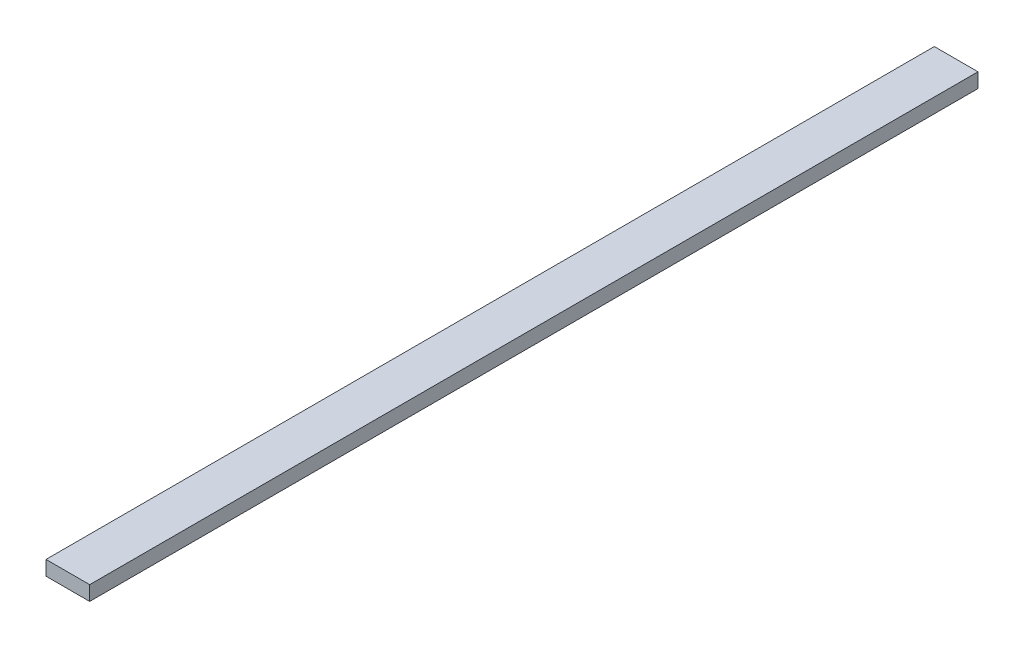
ISO-10303-21;
HEADER;
FILE_DESCRIPTION(('STEP AP214'),'2;1');
FILE_NAME('part.step','',(''),(''),'','','');
FILE_SCHEMA(('AUTOMOTIVE_DESIGN { 1 0 10303 214 1 1 1 1 }'));
ENDSEC;
DATA;
#1=APPLICATION_CONTEXT('core data for automotive mechanical design processes');
#2=APPLICATION_PROTOCOL_DEFINITION('international standard','automotive_design',2000,#1);
#3=PRODUCT_CONTEXT('',#1,'mechanical');
#4=PRODUCT('Part','Part','',(#3));
#5=PRODUCT_RELATED_PRODUCT_CATEGORY('part','',(#4));
#6=PRODUCT_DEFINITION_FORMATION('','',#4);
#7=PRODUCT_DEFINITION_CONTEXT('part definition',#1,'design');
#8=PRODUCT_DEFINITION('design','',#6,#7);
#9=PRODUCT_DEFINITION_SHAPE('','',#8);
#10=(LENGTH_UNIT() NAMED_UNIT(*) SI_UNIT(.MILLI.,.METRE.));
#11=(NAMED_UNIT(*) PLANE_ANGLE_UNIT() SI_UNIT($,.RADIAN.));
#12=(NAMED_UNIT(*) SI_UNIT($,.STERADIAN.) SOLID_ANGLE_UNIT());
#13=UNCERTAINTY_MEASURE_WITH_UNIT(LENGTH_MEASURE(1.E-05),#10,'distance_accuracy_value','');
#14=(GEOMETRIC_REPRESENTATION_CONTEXT(3) GLOBAL_UNCERTAINTY_ASSIGNED_CONTEXT((#13)) GLOBAL_UNIT_ASSIGNED_CONTEXT((#10,
#11,#12)) REPRESENTATION_CONTEXT('',''));
#15=CARTESIAN_POINT('',(0.,0.,0.));
#16=DIRECTION('',(0.,0.,1.));
#17=DIRECTION('',(1.,0.,0.));
#18=AXIS2_PLACEMENT_3D('',#15,#16,#17);
#19=CARTESIAN_POINT('',(168.000000000052,-8.5,305.));
#20=DIRECTION('',(0.,1.,0.));
#21=DIRECTION('',(0.,0.,1.));
#22=AXIS2_PLACEMENT_3D('',#19,#20,#21);
#23=PLANE('',#22);
#24=DIRECTION('',(1.,0.,0.));
#25=VECTOR('',#24,1.);
#26=CARTESIAN_POINT('',(168.000000000052,-8.5,0.));
#27=LINE('',#26,#25);
#28=CARTESIAN_POINT('',(168.000000000052,-8.5,0.));
#29=VERTEX_POINT('',#28);
#30=CARTESIAN_POINT('',(183.000000000052,-8.5,0.));
#31=VERTEX_POINT('',#30);
#32=EDGE_CURVE('E96',#29,#31,#27,.T.);
#33=ORIENTED_EDGE('',*,*,#32,.T.);
#34=DIRECTION('',(0.,0.,-1.));
#35=VECTOR('',#34,1.);
#36=CARTESIAN_POINT('',(183.000000000052,-8.5,305.));
#37=LINE('',#36,#35);
#38=CARTESIAN_POINT('',(183.000000000052,-8.5,305.));
#39=VERTEX_POINT('',#38);
#40=EDGE_CURVE('E11',#39,#31,#37,.T.);
#41=ORIENTED_EDGE('',*,*,#40,.F.);
#42=DIRECTION('',(1.,0.,0.));
#43=VECTOR('',#42,1.);
#44=CARTESIAN_POINT('',(168.000000000052,-8.5,305.));
#45=LINE('',#44,#43);
#46=CARTESIAN_POINT('',(168.000000000052,-8.5,305.));
#47=VERTEX_POINT('',#46);
#48=EDGE_CURVE('E84',#47,#39,#45,.T.);
#49=ORIENTED_EDGE('',*,*,#48,.F.);
#50=DIRECTION('',(0.,0.,-1.));
#51=VECTOR('',#50,1.);
#52=CARTESIAN_POINT('',(168.000000000052,-8.5,305.));
#53=LINE('',#52,#51);
#54=EDGE_CURVE('E92',#47,#29,#53,.T.);
#55=ORIENTED_EDGE('',*,*,#54,.T.);
#56=EDGE_LOOP('',(#33,#41,#49,#55));
#57=FACE_BOUND('',#56,.T.);
#58=ADVANCED_FACE('F33',(#57),#23,.F.);
#59=CARTESIAN_POINT('',(183.000000000052,-8.5,305.));
#60=DIRECTION('',(-1.,0.,0.));
#61=DIRECTION('',(0.,0.,1.));
#62=AXIS2_PLACEMENT_3D('',#59,#60,#61);
#63=PLANE('',#62);
#64=DIRECTION('',(0.,1.,0.));
#65=VECTOR('',#64,1.);
#66=CARTESIAN_POINT('',(183.000000000052,-8.5,0.));
#67=LINE('',#66,#65);
#68=CARTESIAN_POINT('',(183.000000000052,-3.5,0.));
#69=VERTEX_POINT('',#68);
#70=EDGE_CURVE('E88',#31,#69,#67,.T.);
#71=ORIENTED_EDGE('',*,*,#70,.T.);
#72=DIRECTION('',(0.,0.,-1.));
#73=VECTOR('',#72,1.);
#74=CARTESIAN_POINT('',(183.000000000052,-3.5,305.));
#75=LINE('',#74,#73);
#76=CARTESIAN_POINT('',(183.000000000052,-3.5,305.));
#77=VERTEX_POINT('',#76);
#78=EDGE_CURVE('E41',#77,#69,#75,.T.);
#79=ORIENTED_EDGE('',*,*,#78,.F.);
#80=DIRECTION('',(0.,1.,0.));
#81=VECTOR('',#80,1.);
#82=CARTESIAN_POINT('',(183.000000000052,-8.5,305.));
#83=LINE('',#82,#81);
#84=EDGE_CURVE('E79',#39,#77,#83,.T.);
#85=ORIENTED_EDGE('',*,*,#84,.F.);
#86=ORIENTED_EDGE('',*,*,#40,.T.);
#87=EDGE_LOOP('',(#71,#79,#85,#86));
#88=FACE_BOUND('',#87,.T.);
#89=ADVANCED_FACE('F87',(#88),#63,.F.);
#90=CARTESIAN_POINT('',(183.000000000052,-3.5,305.));
#91=DIRECTION('',(0.,-1.,0.));
#92=DIRECTION('',(0.,0.,-1.));
#93=AXIS2_PLACEMENT_3D('',#90,#91,#92);
#94=PLANE('',#93);
#95=DIRECTION('',(-1.,0.,0.));
#96=VECTOR('',#95,1.);
#97=CARTESIAN_POINT('',(183.000000000052,-3.5,0.));
#98=LINE('',#97,#96);
#99=CARTESIAN_POINT('',(168.000000000052,-3.5,0.));
#100=VERTEX_POINT('',#99);
#101=EDGE_CURVE('E66',#69,#100,#98,.T.);
#102=ORIENTED_EDGE('',*,*,#101,.T.);
#103=DIRECTION('',(0.,0.,-1.));
#104=VECTOR('',#103,1.);
#105=CARTESIAN_POINT('',(168.000000000052,-3.5,305.));
#106=LINE('',#105,#104);
#107=CARTESIAN_POINT('',(168.000000000052,-3.5,305.));
#108=VERTEX_POINT('',#107);
#109=EDGE_CURVE('E89',#108,#100,#106,.T.);
#110=ORIENTED_EDGE('',*,*,#109,.F.);
#111=DIRECTION('',(-1.,0.,0.));
#112=VECTOR('',#111,1.);
#113=CARTESIAN_POINT('',(183.000000000052,-3.5,305.));
#114=LINE('',#113,#112);
#115=EDGE_CURVE('E82',#77,#108,#114,.T.);
#116=ORIENTED_EDGE('',*,*,#115,.F.);
#117=ORIENTED_EDGE('',*,*,#78,.T.);
#118=EDGE_LOOP('',(#102,#110,#116,#117));
#119=FACE_BOUND('',#118,.T.);
#120=ADVANCED_FACE('F90',(#119),#94,.F.);
#121=CARTESIAN_POINT('',(168.000000000052,-3.5,305.));
#122=DIRECTION('',(1.,0.,0.));
#123=DIRECTION('',(0.,0.,-1.));
#124=AXIS2_PLACEMENT_3D('',#121,#122,#123);
#125=PLANE('',#124);
#126=DIRECTION('',(0.,-1.,0.));
#127=VECTOR('',#126,1.);
#128=CARTESIAN_POINT('',(168.000000000052,-3.5,0.));
#129=LINE('',#128,#127);
#130=EDGE_CURVE('E72',#100,#29,#129,.T.);
#131=ORIENTED_EDGE('',*,*,#130,.T.);
#132=ORIENTED_EDGE('',*,*,#54,.F.);
#133=DIRECTION('',(0.,-1.,0.));
#134=VECTOR('',#133,1.);
#135=CARTESIAN_POINT('',(168.000000000052,-3.5,305.));
#136=LINE('',#135,#134);
#137=EDGE_CURVE('E49',#108,#47,#136,.T.);
#138=ORIENTED_EDGE('',*,*,#137,.F.);
#139=ORIENTED_EDGE('',*,*,#109,.T.);
#140=EDGE_LOOP('',(#131,#132,#138,#139));
#141=FACE_BOUND('',#140,.T.);
#142=ADVANCED_FACE('F103',(#141),#125,.F.);
#143=CARTESIAN_POINT('',(0.,0.,305.));
#144=DIRECTION('',(0.,0.,1.));
#145=DIRECTION('',(1.,0.,0.));
#146=AXIS2_PLACEMENT_3D('',#143,#144,#145);
#147=PLANE('',#146);
#148=ORIENTED_EDGE('',*,*,#48,.T.);
#149=ORIENTED_EDGE('',*,*,#84,.T.);
#150=ORIENTED_EDGE('',*,*,#115,.T.);
#151=ORIENTED_EDGE('',*,*,#137,.T.);
#152=EDGE_LOOP('',(#148,#149,#150,#151));
#153=FACE_BOUND('',#152,.T.);
#154=ADVANCED_FACE('F80',(#153),#147,.T.);
#155=CARTESIAN_POINT('',(0.,0.,0.));
#156=DIRECTION('',(0.,0.,1.));
#157=DIRECTION('',(1.,0.,0.));
#158=AXIS2_PLACEMENT_3D('',#155,#156,#157);
#159=PLANE('',#158);
#160=ORIENTED_EDGE('',*,*,#32,.F.);
#161=ORIENTED_EDGE('',*,*,#130,.F.);
#162=ORIENTED_EDGE('',*,*,#101,.F.);
#163=ORIENTED_EDGE('',*,*,#70,.F.);
#164=EDGE_LOOP('',(#160,#161,#162,#163));
#165=FACE_BOUND('',#164,.T.);
#166=ADVANCED_FACE('F106',(#165),#159,.F.);
#167=CLOSED_SHELL('',(#58,#89,#120,#142,#154,#166));
#168=MANIFOLD_SOLID_BREP('B2',#167);
#169=ADVANCED_BREP_SHAPE_REPRESENTATION('',(#18,#168),#14);
#170=SHAPE_DEFINITION_REPRESENTATION(#9,#169);
ENDSEC;
END-ISO-10303-21;
